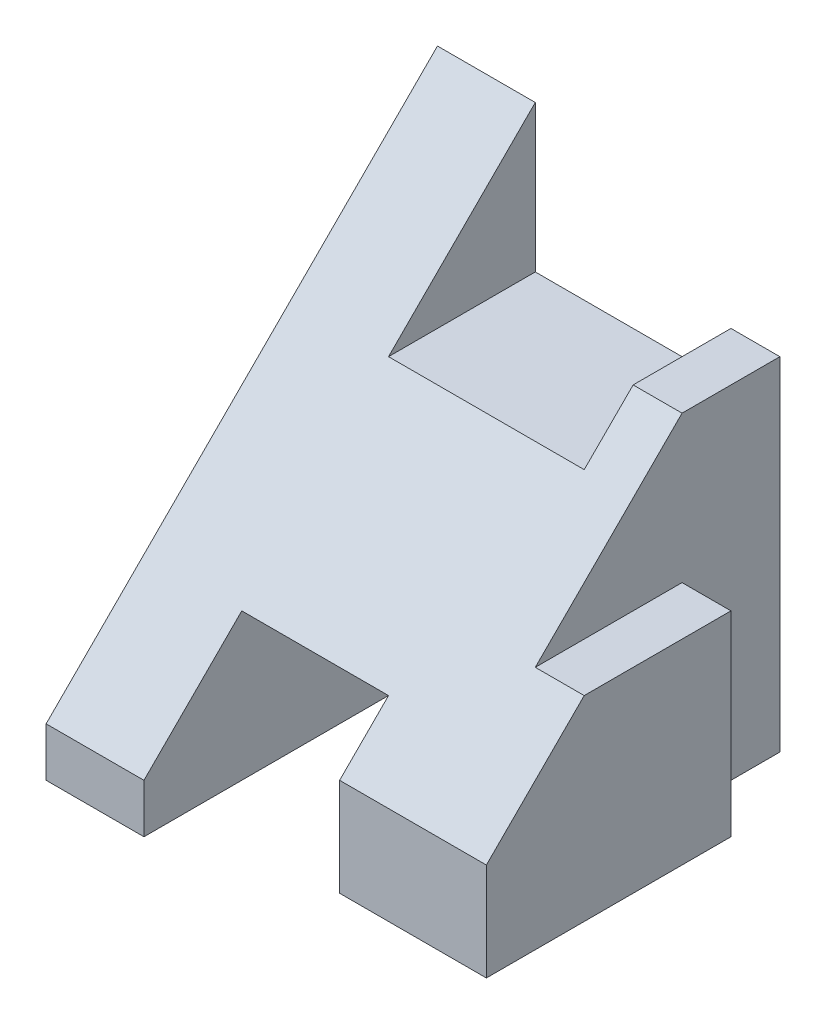
ISO-10303-21;
HEADER;
FILE_DESCRIPTION(('STEP AP214'),'2;1');
FILE_NAME('part.step','',(''),(''),'','','');
FILE_SCHEMA(('AUTOMOTIVE_DESIGN { 1 0 10303 214 1 1 1 1 }'));
ENDSEC;
DATA;
#1=APPLICATION_CONTEXT('core data for automotive mechanical design processes');
#2=APPLICATION_PROTOCOL_DEFINITION('international standard','automotive_design',2000,#1);
#3=PRODUCT_CONTEXT('',#1,'mechanical');
#4=PRODUCT('Part','Part','',(#3));
#5=PRODUCT_RELATED_PRODUCT_CATEGORY('part','',(#4));
#6=PRODUCT_DEFINITION_FORMATION('','',#4);
#7=PRODUCT_DEFINITION_CONTEXT('part definition',#1,'design');
#8=PRODUCT_DEFINITION('design','',#6,#7);
#9=PRODUCT_DEFINITION_SHAPE('','',#8);
#10=(LENGTH_UNIT() NAMED_UNIT(*) SI_UNIT(.MILLI.,.METRE.));
#11=(NAMED_UNIT(*) PLANE_ANGLE_UNIT() SI_UNIT($,.RADIAN.));
#12=(NAMED_UNIT(*) SI_UNIT($,.STERADIAN.) SOLID_ANGLE_UNIT());
#13=UNCERTAINTY_MEASURE_WITH_UNIT(LENGTH_MEASURE(1.E-05),#10,'distance_accuracy_value','');
#14=(GEOMETRIC_REPRESENTATION_CONTEXT(3) GLOBAL_UNCERTAINTY_ASSIGNED_CONTEXT((#13)) GLOBAL_UNIT_ASSIGNED_CONTEXT((#10,
#11,#12)) REPRESENTATION_CONTEXT('',''));
#15=CARTESIAN_POINT('',(0.,0.,0.));
#16=DIRECTION('',(0.,0.,1.));
#17=DIRECTION('',(1.,0.,0.));
#18=AXIS2_PLACEMENT_3D('',#15,#16,#17);
#19=CARTESIAN_POINT('',(-4.,4.5,0.));
#20=DIRECTION('',(0.,-0.707106781186548,-0.707106781186547));
#21=DIRECTION('',(0.,0.707106781186547,-0.707106781186548));
#22=AXIS2_PLACEMENT_3D('',#19,#20,#21);
#23=PLANE('',#22);
#24=DIRECTION('',(1.,0.,0.));
#25=VECTOR('',#24,1.);
#26=CARTESIAN_POINT('',(1.,-2.5,7.));
#27=LINE('',#26,#25);
#28=CARTESIAN_POINT('',(1.,-2.5,7.));
#29=VERTEX_POINT('',#28);
#30=CARTESIAN_POINT('',(4.,-2.5,7.));
#31=VERTEX_POINT('',#30);
#32=EDGE_CURVE('E48',#29,#31,#27,.T.);
#33=ORIENTED_EDGE('',*,*,#32,.T.);
#34=DIRECTION('',(0.,0.707106781186548,-0.707106781186548));
#35=VECTOR('',#34,1.);
#36=CARTESIAN_POINT('',(4.,4.5,0.));
#37=LINE('',#36,#35);
#38=CARTESIAN_POINT('',(4.,-0.500000000000001,5.));
#39=VERTEX_POINT('',#38);
#40=EDGE_CURVE('E155',#31,#39,#37,.T.);
#41=ORIENTED_EDGE('',*,*,#40,.T.);
#42=DIRECTION('',(1.,0.,0.));
#43=VECTOR('',#42,1.);
#44=CARTESIAN_POINT('',(3.,-0.5,5.));
#45=LINE('',#44,#43);
#46=CARTESIAN_POINT('',(3.,-0.5,5.));
#47=VERTEX_POINT('',#46);
#48=EDGE_CURVE('E200',#47,#39,#45,.T.);
#49=ORIENTED_EDGE('',*,*,#48,.F.);
#50=DIRECTION('',(0.,-0.707106781186547,0.707106781186548));
#51=VECTOR('',#50,1.);
#52=CARTESIAN_POINT('',(3.,2.5,2.));
#53=LINE('',#52,#51);
#54=CARTESIAN_POINT('',(3.,2.5,2.));
#55=VERTEX_POINT('',#54);
#56=EDGE_CURVE('E191',#55,#47,#53,.T.);
#57=ORIENTED_EDGE('',*,*,#56,.F.);
#58=DIRECTION('',(1.,0.,0.));
#59=VECTOR('',#58,1.);
#60=CARTESIAN_POINT('',(2.,2.5,2.));
#61=LINE('',#60,#59);
#62=CARTESIAN_POINT('',(2.,2.5,2.));
#63=VERTEX_POINT('',#62);
#64=EDGE_CURVE('E215',#63,#55,#61,.T.);
#65=ORIENTED_EDGE('',*,*,#64,.F.);
#66=DIRECTION('',(0.,0.707106781186547,-0.707106781186548));
#67=VECTOR('',#66,1.);
#68=CARTESIAN_POINT('',(2.,1.5,3.));
#69=LINE('',#68,#67);
#70=CARTESIAN_POINT('',(2.,1.5,3.));
#71=VERTEX_POINT('',#70);
#72=EDGE_CURVE('E176',#71,#63,#69,.T.);
#73=ORIENTED_EDGE('',*,*,#72,.F.);
#74=DIRECTION('',(1.,0.,0.));
#75=VECTOR('',#74,1.);
#76=CARTESIAN_POINT('',(-2.,1.5,3.));
#77=LINE('',#76,#75);
#78=CARTESIAN_POINT('',(-2.,1.5,3.));
#79=VERTEX_POINT('',#78);
#80=EDGE_CURVE('E224',#79,#71,#77,.T.);
#81=ORIENTED_EDGE('',*,*,#80,.F.);
#82=DIRECTION('',(0.,-0.707106781186547,0.707106781186548));
#83=VECTOR('',#82,1.);
#84=CARTESIAN_POINT('',(-2.,3.,1.5));
#85=LINE('',#84,#83);
#86=CARTESIAN_POINT('',(-2.,4.5,0.));
#87=VERTEX_POINT('',#86);
#88=EDGE_CURVE('E179',#87,#79,#85,.T.);
#89=ORIENTED_EDGE('',*,*,#88,.F.);
#90=DIRECTION('',(-1.,0.,0.));
#91=VECTOR('',#90,1.);
#92=CARTESIAN_POINT('',(4.,4.5,0.));
#93=LINE('',#92,#91);
#94=CARTESIAN_POINT('',(-4.,4.5,0.));
#95=VERTEX_POINT('',#94);
#96=EDGE_CURVE('E239',#87,#95,#93,.T.);
#97=ORIENTED_EDGE('',*,*,#96,.T.);
#98=DIRECTION('',(0.,0.707106781186548,-0.707106781186548));
#99=VECTOR('',#98,1.);
#100=CARTESIAN_POINT('',(-4.,4.5,0.));
#101=LINE('',#100,#99);
#102=CARTESIAN_POINT('',(-4.,-3.5,8.));
#103=VERTEX_POINT('',#102);
#104=EDGE_CURVE('E164',#103,#95,#101,.T.);
#105=ORIENTED_EDGE('',*,*,#104,.F.);
#106=DIRECTION('',(1.,0.,0.));
#107=VECTOR('',#106,1.);
#108=CARTESIAN_POINT('',(-4.,-3.5,8.));
#109=LINE('',#108,#107);
#110=CARTESIAN_POINT('',(-2.,-3.5,8.));
#111=VERTEX_POINT('',#110);
#112=EDGE_CURVE('E168',#103,#111,#109,.T.);
#113=ORIENTED_EDGE('',*,*,#112,.T.);
#114=DIRECTION('',(0.,0.707106781186547,-0.707106781186548));
#115=VECTOR('',#114,1.);
#116=CARTESIAN_POINT('',(-2.,4.5,0.));
#117=LINE('',#116,#115);
#118=CARTESIAN_POINT('',(-2.,-1.5,6.));
#119=VERTEX_POINT('',#118);
#120=EDGE_CURVE('E254',#111,#119,#117,.T.);
#121=ORIENTED_EDGE('',*,*,#120,.T.);
#122=DIRECTION('',(1.,0.,0.));
#123=VECTOR('',#122,1.);
#124=CARTESIAN_POINT('',(-4.,-1.5,6.));
#125=LINE('',#124,#123);
#126=CARTESIAN_POINT('',(1.,-1.5,6.));
#127=VERTEX_POINT('',#126);
#128=EDGE_CURVE('E41',#119,#127,#125,.T.);
#129=ORIENTED_EDGE('',*,*,#128,.T.);
#130=DIRECTION('',(0.,-0.707106781186547,0.707106781186548));
#131=VECTOR('',#130,1.);
#132=CARTESIAN_POINT('',(1.,4.5,0.));
#133=LINE('',#132,#131);
#134=EDGE_CURVE('E11',#127,#29,#133,.T.);
#135=ORIENTED_EDGE('',*,*,#134,.T.);
#136=EDGE_LOOP('',(#33,#41,#49,#57,#65,#73,#81,#89,#97,#105,#113,#121,#129,#135));
#137=FACE_BOUND('',#136,.T.);
#138=ADVANCED_FACE('F33',(#137),#23,.F.);
#139=CARTESIAN_POINT('',(4.,-4.5,8.));
#140=DIRECTION('',(0.,1.,0.));
#141=DIRECTION('',(-1.,0.,0.));
#142=AXIS2_PLACEMENT_3D('',#139,#140,#141);
#143=PLANE('',#142);
#144=DIRECTION('',(0.,0.,-1.));
#145=VECTOR('',#144,1.);
#146=CARTESIAN_POINT('',(4.,-4.5,8.));
#147=LINE('',#146,#145);
#148=CARTESIAN_POINT('',(4.,-4.5,7.));
#149=VERTEX_POINT('',#148);
#150=CARTESIAN_POINT('',(4.,-4.5,2.));
#151=VERTEX_POINT('',#150);
#152=EDGE_CURVE('E242',#149,#151,#147,.T.);
#153=ORIENTED_EDGE('',*,*,#152,.F.);
#154=DIRECTION('',(1.,0.,0.));
#155=VECTOR('',#154,1.);
#156=CARTESIAN_POINT('',(1.,-4.5,7.));
#157=LINE('',#156,#155);
#158=CARTESIAN_POINT('',(1.,-4.5,7.));
#159=VERTEX_POINT('',#158);
#160=EDGE_CURVE('E147',#159,#149,#157,.T.);
#161=ORIENTED_EDGE('',*,*,#160,.F.);
#162=DIRECTION('',(0.,0.,-1.));
#163=VECTOR('',#162,1.);
#164=CARTESIAN_POINT('',(1.,-4.5,8.));
#165=LINE('',#164,#163);
#166=CARTESIAN_POINT('',(1.,-4.5,0.));
#167=VERTEX_POINT('',#166);
#168=EDGE_CURVE('E165',#159,#167,#165,.T.);
#169=ORIENTED_EDGE('',*,*,#168,.T.);
#170=DIRECTION('',(1.,0.,0.));
#171=VECTOR('',#170,1.);
#172=CARTESIAN_POINT('',(4.,-4.5,0.));
#173=LINE('',#172,#171);
#174=CARTESIAN_POINT('',(3.,-4.5,0.));
#175=VERTEX_POINT('',#174);
#176=EDGE_CURVE('E245',#167,#175,#173,.T.);
#177=ORIENTED_EDGE('',*,*,#176,.T.);
#178=DIRECTION('',(0.,0.,-1.));
#179=VECTOR('',#178,1.);
#180=CARTESIAN_POINT('',(3.,-4.5,2.));
#181=LINE('',#180,#179);
#182=CARTESIAN_POINT('',(3.,-4.5,2.));
#183=VERTEX_POINT('',#182);
#184=EDGE_CURVE('E182',#183,#175,#181,.T.);
#185=ORIENTED_EDGE('',*,*,#184,.F.);
#186=DIRECTION('',(1.,0.,0.));
#187=VECTOR('',#186,1.);
#188=CARTESIAN_POINT('',(3.,-4.5,2.));
#189=LINE('',#188,#187);
#190=EDGE_CURVE('E204',#183,#151,#189,.T.);
#191=ORIENTED_EDGE('',*,*,#190,.T.);
#192=EDGE_LOOP('',(#153,#161,#169,#177,#185,#191));
#193=FACE_BOUND('',#192,.T.);
#194=ADVANCED_FACE('F288',(#193),#143,.F.);
#195=CARTESIAN_POINT('',(0.,0.,0.));
#196=DIRECTION('',(0.,0.,1.));
#197=DIRECTION('',(1.,0.,0.));
#198=AXIS2_PLACEMENT_3D('',#195,#196,#197);
#199=PLANE('',#198);
#200=ORIENTED_EDGE('',*,*,#176,.F.);
#201=DIRECTION('',(0.,-1.,0.));
#202=VECTOR('',#201,1.);
#203=CARTESIAN_POINT('',(1.,-4.5,0.));
#204=LINE('',#203,#202);
#205=CARTESIAN_POINT('',(1.,-1.5,0.));
#206=VERTEX_POINT('',#205);
#207=EDGE_CURVE('E273',#206,#167,#204,.T.);
#208=ORIENTED_EDGE('',*,*,#207,.F.);
#209=DIRECTION('',(1.,0.,0.));
#210=VECTOR('',#209,1.);
#211=CARTESIAN_POINT('',(1.,-1.5,0.));
#212=LINE('',#211,#210);
#213=CARTESIAN_POINT('',(-2.,-1.5,0.));
#214=VERTEX_POINT('',#213);
#215=EDGE_CURVE('E261',#214,#206,#212,.T.);
#216=ORIENTED_EDGE('',*,*,#215,.F.);
#217=DIRECTION('',(0.,1.,0.));
#218=VECTOR('',#217,1.);
#219=CARTESIAN_POINT('',(-2.,-1.5,0.));
#220=LINE('',#219,#218);
#221=CARTESIAN_POINT('',(-2.,-4.5,0.));
#222=VERTEX_POINT('',#221);
#223=EDGE_CURVE('E151',#222,#214,#220,.T.);
#224=ORIENTED_EDGE('',*,*,#223,.F.);
#225=CARTESIAN_POINT('',(-4.,-4.5,0.));
#226=VERTEX_POINT('',#225);
#227=EDGE_CURVE('E246',#226,#222,#173,.T.);
#228=ORIENTED_EDGE('',*,*,#227,.F.);
#229=DIRECTION('',(0.,-1.,0.));
#230=VECTOR('',#229,1.);
#231=CARTESIAN_POINT('',(-4.,-4.5,0.));
#232=LINE('',#231,#230);
#233=EDGE_CURVE('E233',#95,#226,#232,.T.);
#234=ORIENTED_EDGE('',*,*,#233,.F.);
#235=ORIENTED_EDGE('',*,*,#96,.F.);
#236=DIRECTION('',(0.,1.,0.));
#237=VECTOR('',#236,1.);
#238=CARTESIAN_POINT('',(-2.,1.5,0.));
#239=LINE('',#238,#237);
#240=CARTESIAN_POINT('',(-2.,1.5,0.));
#241=VERTEX_POINT('',#240);
#242=EDGE_CURVE('E229',#241,#87,#239,.T.);
#243=ORIENTED_EDGE('',*,*,#242,.F.);
#244=DIRECTION('',(-1.,0.,0.));
#245=VECTOR('',#244,1.);
#246=CARTESIAN_POINT('',(2.,1.5,0.));
#247=LINE('',#246,#245);
#248=CARTESIAN_POINT('',(2.,1.5,0.));
#249=VERTEX_POINT('',#248);
#250=EDGE_CURVE('E218',#249,#241,#247,.T.);
#251=ORIENTED_EDGE('',*,*,#250,.F.);
#252=DIRECTION('',(0.,1.,0.));
#253=VECTOR('',#252,1.);
#254=CARTESIAN_POINT('',(2.,1.5,0.));
#255=LINE('',#254,#253);
#256=CARTESIAN_POINT('',(2.,2.5,0.));
#257=VERTEX_POINT('',#256);
#258=EDGE_CURVE('E230',#249,#257,#255,.T.);
#259=ORIENTED_EDGE('',*,*,#258,.T.);
#260=DIRECTION('',(-1.,0.,0.));
#261=VECTOR('',#260,1.);
#262=CARTESIAN_POINT('',(4.,2.5,0.));
#263=LINE('',#262,#261);
#264=CARTESIAN_POINT('',(3.,2.5,0.));
#265=VERTEX_POINT('',#264);
#266=EDGE_CURVE('E207',#265,#257,#263,.T.);
#267=ORIENTED_EDGE('',*,*,#266,.F.);
#268=DIRECTION('',(0.,1.,0.));
#269=VECTOR('',#268,1.);
#270=CARTESIAN_POINT('',(3.,-4.5,0.));
#271=LINE('',#270,#269);
#272=EDGE_CURVE('E185',#175,#265,#271,.T.);
#273=ORIENTED_EDGE('',*,*,#272,.F.);
#274=EDGE_LOOP('',(#200,#208,#216,#224,#228,#234,#235,#243,#251,#259,#267,#273));
#275=FACE_BOUND('',#274,.T.);
#276=ADVANCED_FACE('F283',(#275),#199,.F.);
#277=CARTESIAN_POINT('',(0.,2.5,0.));
#278=DIRECTION('',(0.,1.,0.));
#279=DIRECTION('',(0.,0.,1.));
#280=AXIS2_PLACEMENT_3D('',#277,#278,#279);
#281=PLANE('',#280);
#282=ORIENTED_EDGE('',*,*,#64,.T.);
#283=DIRECTION('',(0.,0.,1.));
#284=VECTOR('',#283,1.);
#285=CARTESIAN_POINT('',(3.,2.5,0.));
#286=LINE('',#285,#284);
#287=EDGE_CURVE('E188',#265,#55,#286,.T.);
#288=ORIENTED_EDGE('',*,*,#287,.F.);
#289=ORIENTED_EDGE('',*,*,#266,.T.);
#290=DIRECTION('',(0.,0.,1.));
#291=VECTOR('',#290,1.);
#292=CARTESIAN_POINT('',(2.,2.5,0.));
#293=LINE('',#292,#291);
#294=EDGE_CURVE('E212',#257,#63,#293,.T.);
#295=ORIENTED_EDGE('',*,*,#294,.T.);
#296=EDGE_LOOP('',(#282,#288,#289,#295));
#297=FACE_BOUND('',#296,.T.);
#298=ADVANCED_FACE('F302',(#297),#281,.T.);
#299=CARTESIAN_POINT('',(-4.,-4.5,8.));
#300=DIRECTION('',(1.,0.,0.));
#301=DIRECTION('',(0.,0.,-1.));
#302=AXIS2_PLACEMENT_3D('',#299,#300,#301);
#303=PLANE('',#302);
#304=DIRECTION('',(0.,-1.,0.));
#305=VECTOR('',#304,1.);
#306=CARTESIAN_POINT('',(-4.,-4.5,8.));
#307=LINE('',#306,#305);
#308=CARTESIAN_POINT('',(-4.,-4.5,8.));
#309=VERTEX_POINT('',#308);
#310=EDGE_CURVE('E236',#103,#309,#307,.T.);
#311=ORIENTED_EDGE('',*,*,#310,.F.);
#312=ORIENTED_EDGE('',*,*,#104,.T.);
#313=ORIENTED_EDGE('',*,*,#233,.T.);
#314=DIRECTION('',(0.,0.,-1.));
#315=VECTOR('',#314,1.);
#316=CARTESIAN_POINT('',(-4.,-4.5,8.));
#317=LINE('',#316,#315);
#318=EDGE_CURVE('E251',#309,#226,#317,.T.);
#319=ORIENTED_EDGE('',*,*,#318,.F.);
#320=EDGE_LOOP('',(#311,#312,#313,#319));
#321=FACE_BOUND('',#320,.T.);
#322=ADVANCED_FACE('F35',(#321),#303,.F.);
#323=ORIENTED_EDGE('',*,*,#227,.T.);
#324=DIRECTION('',(0.,0.,-1.));
#325=VECTOR('',#324,1.);
#326=CARTESIAN_POINT('',(-2.,-4.5,8.));
#327=LINE('',#326,#325);
#328=CARTESIAN_POINT('',(-2.,-4.5,8.));
#329=VERTEX_POINT('',#328);
#330=EDGE_CURVE('E266',#329,#222,#327,.T.);
#331=ORIENTED_EDGE('',*,*,#330,.F.);
#332=DIRECTION('',(1.,0.,0.));
#333=VECTOR('',#332,1.);
#334=CARTESIAN_POINT('',(4.,-4.5,8.));
#335=LINE('',#334,#333);
#336=EDGE_CURVE('E238',#309,#329,#335,.T.);
#337=ORIENTED_EDGE('',*,*,#336,.F.);
#338=ORIENTED_EDGE('',*,*,#318,.T.);
#339=EDGE_LOOP('',(#323,#331,#337,#338));
#340=FACE_BOUND('',#339,.T.);
#341=ADVANCED_FACE('F322',(#340),#143,.F.);
#342=CARTESIAN_POINT('',(4.,-4.5,8.));
#343=DIRECTION('',(-1.,0.,0.));
#344=DIRECTION('',(0.,0.,1.));
#345=AXIS2_PLACEMENT_3D('',#342,#343,#344);
#346=PLANE('',#345);
#347=ORIENTED_EDGE('',*,*,#40,.F.);
#348=DIRECTION('',(0.,-1.,0.));
#349=VECTOR('',#348,1.);
#350=CARTESIAN_POINT('',(4.,-2.5,7.));
#351=LINE('',#350,#349);
#352=EDGE_CURVE('E144',#31,#149,#351,.T.);
#353=ORIENTED_EDGE('',*,*,#352,.T.);
#354=ORIENTED_EDGE('',*,*,#152,.T.);
#355=DIRECTION('',(0.,-1.,0.));
#356=VECTOR('',#355,1.);
#357=CARTESIAN_POINT('',(4.,-0.5,2.));
#358=LINE('',#357,#356);
#359=CARTESIAN_POINT('',(4.,-0.5,2.));
#360=VERTEX_POINT('',#359);
#361=EDGE_CURVE('E186',#360,#151,#358,.T.);
#362=ORIENTED_EDGE('',*,*,#361,.F.);
#363=DIRECTION('',(0.,0.,-1.));
#364=VECTOR('',#363,1.);
#365=CARTESIAN_POINT('',(4.,-0.5,5.));
#366=LINE('',#365,#364);
#367=EDGE_CURVE('E163',#39,#360,#366,.T.);
#368=ORIENTED_EDGE('',*,*,#367,.F.);
#369=EDGE_LOOP('',(#347,#353,#354,#362,#368));
#370=FACE_BOUND('',#369,.T.);
#371=ADVANCED_FACE('F160',(#370),#346,.F.);
#372=CARTESIAN_POINT('',(0.,0.,8.));
#373=DIRECTION('',(0.,0.,1.));
#374=DIRECTION('',(1.,0.,0.));
#375=AXIS2_PLACEMENT_3D('',#372,#373,#374);
#376=PLANE('',#375);
#377=DIRECTION('',(0.,1.,0.));
#378=VECTOR('',#377,1.);
#379=CARTESIAN_POINT('',(-2.,-1.5,8.));
#380=LINE('',#379,#378);
#381=EDGE_CURVE('E269',#329,#111,#380,.T.);
#382=ORIENTED_EDGE('',*,*,#381,.T.);
#383=ORIENTED_EDGE('',*,*,#112,.F.);
#384=ORIENTED_EDGE('',*,*,#310,.T.);
#385=ORIENTED_EDGE('',*,*,#336,.T.);
#386=EDGE_LOOP('',(#382,#383,#384,#385));
#387=FACE_BOUND('',#386,.T.);
#388=ADVANCED_FACE('F320',(#387),#376,.T.);
#389=CARTESIAN_POINT('',(2.,1.5,3.));
#390=DIRECTION('',(1.,0.,0.));
#391=DIRECTION('',(0.,0.,-1.));
#392=AXIS2_PLACEMENT_3D('',#389,#390,#391);
#393=PLANE('',#392);
#394=DIRECTION('',(0.,0.,-1.));
#395=VECTOR('',#394,1.);
#396=CARTESIAN_POINT('',(2.,1.5,3.));
#397=LINE('',#396,#395);
#398=EDGE_CURVE('E227',#71,#249,#397,.T.);
#399=ORIENTED_EDGE('',*,*,#398,.F.);
#400=ORIENTED_EDGE('',*,*,#72,.T.);
#401=ORIENTED_EDGE('',*,*,#294,.F.);
#402=ORIENTED_EDGE('',*,*,#258,.F.);
#403=EDGE_LOOP('',(#399,#400,#401,#402));
#404=FACE_BOUND('',#403,.T.);
#405=ADVANCED_FACE('F307',(#404),#393,.F.);
#406=CARTESIAN_POINT('',(-2.,1.5,0.));
#407=DIRECTION('',(-1.,0.,0.));
#408=DIRECTION('',(0.,0.,1.));
#409=AXIS2_PLACEMENT_3D('',#406,#407,#408);
#410=PLANE('',#409);
#411=ORIENTED_EDGE('',*,*,#242,.T.);
#412=ORIENTED_EDGE('',*,*,#88,.T.);
#413=DIRECTION('',(0.,0.,1.));
#414=VECTOR('',#413,1.);
#415=CARTESIAN_POINT('',(-2.,1.5,0.));
#416=LINE('',#415,#414);
#417=EDGE_CURVE('E221',#241,#79,#416,.T.);
#418=ORIENTED_EDGE('',*,*,#417,.F.);
#419=EDGE_LOOP('',(#411,#412,#418));
#420=FACE_BOUND('',#419,.T.);
#421=ADVANCED_FACE('F314',(#420),#410,.F.);
#422=CARTESIAN_POINT('',(0.,1.5,0.));
#423=DIRECTION('',(0.,1.,0.));
#424=DIRECTION('',(0.,0.,1.));
#425=AXIS2_PLACEMENT_3D('',#422,#423,#424);
#426=PLANE('',#425);
#427=ORIENTED_EDGE('',*,*,#250,.T.);
#428=ORIENTED_EDGE('',*,*,#417,.T.);
#429=ORIENTED_EDGE('',*,*,#80,.T.);
#430=ORIENTED_EDGE('',*,*,#398,.T.);
#431=EDGE_LOOP('',(#427,#428,#429,#430));
#432=FACE_BOUND('',#431,.T.);
#433=ADVANCED_FACE('F312',(#432),#426,.T.);
#434=CARTESIAN_POINT('',(3.,-0.5,2.));
#435=DIRECTION('',(0.,0.,1.));
#436=DIRECTION('',(1.,0.,0.));
#437=AXIS2_PLACEMENT_3D('',#434,#435,#436);
#438=PLANE('',#437);
#439=ORIENTED_EDGE('',*,*,#361,.T.);
#440=ORIENTED_EDGE('',*,*,#190,.F.);
#441=DIRECTION('',(0.,-1.,0.));
#442=VECTOR('',#441,1.);
#443=CARTESIAN_POINT('',(3.,-0.5,2.));
#444=LINE('',#443,#442);
#445=CARTESIAN_POINT('',(3.,-0.5,2.));
#446=VERTEX_POINT('',#445);
#447=EDGE_CURVE('E197',#446,#183,#444,.T.);
#448=ORIENTED_EDGE('',*,*,#447,.F.);
#449=DIRECTION('',(1.,0.,0.));
#450=VECTOR('',#449,1.);
#451=CARTESIAN_POINT('',(3.,-0.5,2.));
#452=LINE('',#451,#450);
#453=EDGE_CURVE('E208',#446,#360,#452,.T.);
#454=ORIENTED_EDGE('',*,*,#453,.T.);
#455=EDGE_LOOP('',(#439,#440,#448,#454));
#456=FACE_BOUND('',#455,.T.);
#457=ADVANCED_FACE('F292',(#456),#438,.F.);
#458=CARTESIAN_POINT('',(3.,-0.5,5.));
#459=DIRECTION('',(0.,-1.,0.));
#460=DIRECTION('',(0.,0.,-1.));
#461=AXIS2_PLACEMENT_3D('',#458,#459,#460);
#462=PLANE('',#461);
#463=ORIENTED_EDGE('',*,*,#367,.T.);
#464=ORIENTED_EDGE('',*,*,#453,.F.);
#465=DIRECTION('',(0.,0.,-1.));
#466=VECTOR('',#465,1.);
#467=CARTESIAN_POINT('',(3.,-0.5,5.));
#468=LINE('',#467,#466);
#469=EDGE_CURVE('E194',#47,#446,#468,.T.);
#470=ORIENTED_EDGE('',*,*,#469,.F.);
#471=ORIENTED_EDGE('',*,*,#48,.T.);
#472=EDGE_LOOP('',(#463,#464,#470,#471));
#473=FACE_BOUND('',#472,.T.);
#474=ADVANCED_FACE('F296',(#473),#462,.F.);
#475=CARTESIAN_POINT('',(3.,0.,0.));
#476=DIRECTION('',(1.,0.,0.));
#477=DIRECTION('',(0.,0.,-1.));
#478=AXIS2_PLACEMENT_3D('',#475,#476,#477);
#479=PLANE('',#478);
#480=ORIENTED_EDGE('',*,*,#184,.T.);
#481=ORIENTED_EDGE('',*,*,#272,.T.);
#482=ORIENTED_EDGE('',*,*,#287,.T.);
#483=ORIENTED_EDGE('',*,*,#56,.T.);
#484=ORIENTED_EDGE('',*,*,#469,.T.);
#485=ORIENTED_EDGE('',*,*,#447,.T.);
#486=EDGE_LOOP('',(#480,#481,#482,#483,#484,#485));
#487=FACE_BOUND('',#486,.T.);
#488=ADVANCED_FACE('F299',(#487),#479,.T.);
#489=CARTESIAN_POINT('',(1.,-4.5,8.));
#490=DIRECTION('',(1.,0.,0.));
#491=DIRECTION('',(0.,0.,-1.));
#492=AXIS2_PLACEMENT_3D('',#489,#490,#491);
#493=PLANE('',#492);
#494=ORIENTED_EDGE('',*,*,#168,.F.);
#495=DIRECTION('',(0.,-1.,0.));
#496=VECTOR('',#495,1.);
#497=CARTESIAN_POINT('',(1.,-2.5,7.));
#498=LINE('',#497,#496);
#499=EDGE_CURVE('E152',#29,#159,#498,.T.);
#500=ORIENTED_EDGE('',*,*,#499,.F.);
#501=ORIENTED_EDGE('',*,*,#134,.F.);
#502=DIRECTION('',(0.,0.,-1.));
#503=VECTOR('',#502,1.);
#504=CARTESIAN_POINT('',(1.,-1.5,8.));
#505=LINE('',#504,#503);
#506=EDGE_CURVE('E170',#127,#206,#505,.T.);
#507=ORIENTED_EDGE('',*,*,#506,.T.);
#508=ORIENTED_EDGE('',*,*,#207,.T.);
#509=EDGE_LOOP('',(#494,#500,#501,#507,#508));
#510=FACE_BOUND('',#509,.T.);
#511=ADVANCED_FACE('F286',(#510),#493,.F.);
#512=CARTESIAN_POINT('',(1.,-1.5,8.));
#513=DIRECTION('',(0.,1.,0.));
#514=DIRECTION('',(0.,0.,1.));
#515=AXIS2_PLACEMENT_3D('',#512,#513,#514);
#516=PLANE('',#515);
#517=DIRECTION('',(0.,0.,-1.));
#518=VECTOR('',#517,1.);
#519=CARTESIAN_POINT('',(-2.,-1.5,8.));
#520=LINE('',#519,#518);
#521=EDGE_CURVE('E56',#119,#214,#520,.T.);
#522=ORIENTED_EDGE('',*,*,#521,.T.);
#523=ORIENTED_EDGE('',*,*,#215,.T.);
#524=ORIENTED_EDGE('',*,*,#506,.F.);
#525=ORIENTED_EDGE('',*,*,#128,.F.);
#526=EDGE_LOOP('',(#522,#523,#524,#525));
#527=FACE_BOUND('',#526,.T.);
#528=ADVANCED_FACE('F258',(#527),#516,.F.);
#529=CARTESIAN_POINT('',(-2.,-1.5,8.));
#530=DIRECTION('',(-1.,0.,0.));
#531=DIRECTION('',(0.,0.,1.));
#532=AXIS2_PLACEMENT_3D('',#529,#530,#531);
#533=PLANE('',#532);
#534=ORIENTED_EDGE('',*,*,#381,.F.);
#535=ORIENTED_EDGE('',*,*,#330,.T.);
#536=ORIENTED_EDGE('',*,*,#223,.T.);
#537=ORIENTED_EDGE('',*,*,#521,.F.);
#538=ORIENTED_EDGE('',*,*,#120,.F.);
#539=EDGE_LOOP('',(#534,#535,#536,#537,#538));
#540=FACE_BOUND('',#539,.T.);
#541=ADVANCED_FACE('F280',(#540),#533,.F.);
#542=CARTESIAN_POINT('',(1.,-2.5,7.));
#543=DIRECTION('',(0.,0.,-1.));
#544=DIRECTION('',(-1.,0.,0.));
#545=AXIS2_PLACEMENT_3D('',#542,#543,#544);
#546=PLANE('',#545);
#547=ORIENTED_EDGE('',*,*,#160,.T.);
#548=ORIENTED_EDGE('',*,*,#352,.F.);
#549=ORIENTED_EDGE('',*,*,#32,.F.);
#550=ORIENTED_EDGE('',*,*,#499,.T.);
#551=EDGE_LOOP('',(#547,#548,#549,#550));
#552=FACE_BOUND('',#551,.T.);
#553=ADVANCED_FACE('F145',(#552),#546,.F.);
#554=CLOSED_SHELL('',(#138,#194,#276,#298,#322,#341,#371,#388,#405,#421,#433,#457,#474,#488,
#511,#528,#541,#553));
#555=MANIFOLD_SOLID_BREP('B2',#554);
#556=ADVANCED_BREP_SHAPE_REPRESENTATION('',(#18,#555),#14);
#557=SHAPE_DEFINITION_REPRESENTATION(#9,#556);
ENDSEC;
END-ISO-10303-21;
